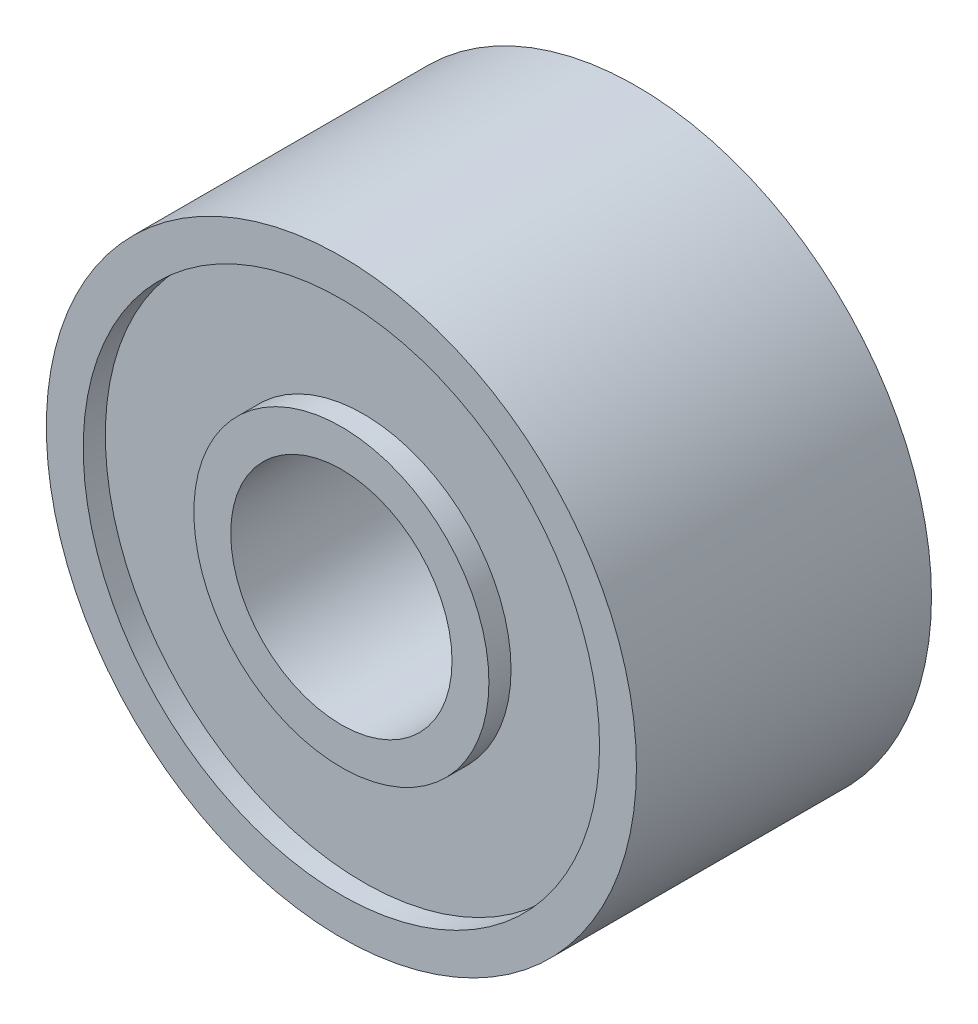
ISO-10303-21;
HEADER;
FILE_DESCRIPTION(('STEP AP214'),'2;1');
FILE_NAME('part.step','',(''),(''),'','','');
FILE_SCHEMA(('AUTOMOTIVE_DESIGN { 1 0 10303 214 1 1 1 1 }'));
ENDSEC;
DATA;
#1=APPLICATION_CONTEXT('core data for automotive mechanical design processes');
#2=APPLICATION_PROTOCOL_DEFINITION('international standard','automotive_design',2000,#1);
#3=PRODUCT_CONTEXT('',#1,'mechanical');
#4=PRODUCT('Part','Part','',(#3));
#5=PRODUCT_RELATED_PRODUCT_CATEGORY('part','',(#4));
#6=PRODUCT_DEFINITION_FORMATION('','',#4);
#7=PRODUCT_DEFINITION_CONTEXT('part definition',#1,'design');
#8=PRODUCT_DEFINITION('design','',#6,#7);
#9=PRODUCT_DEFINITION_SHAPE('','',#8);
#10=(LENGTH_UNIT() NAMED_UNIT(*) SI_UNIT(.MILLI.,.METRE.));
#11=(NAMED_UNIT(*) PLANE_ANGLE_UNIT() SI_UNIT($,.RADIAN.));
#12=(NAMED_UNIT(*) SI_UNIT($,.STERADIAN.) SOLID_ANGLE_UNIT());
#13=UNCERTAINTY_MEASURE_WITH_UNIT(LENGTH_MEASURE(1.E-05),#10,'distance_accuracy_value','');
#14=(GEOMETRIC_REPRESENTATION_CONTEXT(3) GLOBAL_UNCERTAINTY_ASSIGNED_CONTEXT((#13)) GLOBAL_UNIT_ASSIGNED_CONTEXT((#10,
#11,#12)) REPRESENTATION_CONTEXT('',''));
#15=CARTESIAN_POINT('',(0.,0.,0.));
#16=DIRECTION('',(0.,0.,1.));
#17=DIRECTION('',(1.,0.,0.));
#18=AXIS2_PLACEMENT_3D('',#15,#16,#17);
#19=CARTESIAN_POINT('',(0.,0.,0.));
#20=DIRECTION('',(0.,0.,1.));
#21=DIRECTION('',(1.,0.,0.));
#22=AXIS2_PLACEMENT_3D('',#19,#20,#21);
#23=PLANE('',#22);
#24=CARTESIAN_POINT('',(0.,0.,0.));
#25=DIRECTION('',(0.,0.,1.));
#26=DIRECTION('',(1.,0.,0.));
#27=AXIS2_PLACEMENT_3D('',#24,#25,#26);
#28=CIRCLE('',#27,1.5);
#29=CARTESIAN_POINT('',(1.5,0.,0.));
#30=VERTEX_POINT('',#29);
#31=EDGE_CURVE('E41',#30,#30,#28,.T.);
#32=ORIENTED_EDGE('',*,*,#31,.T.);
#33=EDGE_LOOP('',(#32));
#34=FACE_BOUND('',#33,.T.);
#35=CARTESIAN_POINT('',(0.,0.,0.));
#36=DIRECTION('',(0.,0.,-1.));
#37=DIRECTION('',(-1.,0.,0.));
#38=AXIS2_PLACEMENT_3D('',#35,#36,#37);
#39=CIRCLE('',#38,2.);
#40=CARTESIAN_POINT('',(-2.,0.,0.));
#41=VERTEX_POINT('',#40);
#42=EDGE_CURVE('E67',#41,#41,#39,.T.);
#43=ORIENTED_EDGE('',*,*,#42,.T.);
#44=EDGE_LOOP('',(#43));
#45=FACE_BOUND('',#44,.T.);
#46=ADVANCED_FACE('F30',(#34,#45),#23,.F.);
#47=CARTESIAN_POINT('',(0.,0.,4.));
#48=DIRECTION('',(0.,0.,1.));
#49=DIRECTION('',(1.,0.,0.));
#50=AXIS2_PLACEMENT_3D('',#47,#48,#49);
#51=PLANE('',#50);
#52=CARTESIAN_POINT('',(0.,0.,4.));
#53=DIRECTION('',(0.,0.,1.));
#54=DIRECTION('',(1.,0.,0.));
#55=AXIS2_PLACEMENT_3D('',#52,#53,#54);
#56=CIRCLE('',#55,1.5);
#57=CARTESIAN_POINT('',(1.5,0.,4.));
#58=VERTEX_POINT('',#57);
#59=EDGE_CURVE('E43',#58,#58,#56,.T.);
#60=ORIENTED_EDGE('',*,*,#59,.F.);
#61=EDGE_LOOP('',(#60));
#62=FACE_BOUND('',#61,.T.);
#63=CARTESIAN_POINT('',(0.,0.,4.));
#64=DIRECTION('',(0.,0.,1.));
#65=DIRECTION('',(1.,0.,0.));
#66=AXIS2_PLACEMENT_3D('',#63,#64,#65);
#67=CIRCLE('',#66,2.);
#68=CARTESIAN_POINT('',(2.,0.,4.));
#69=VERTEX_POINT('',#68);
#70=EDGE_CURVE('E55',#69,#69,#67,.T.);
#71=ORIENTED_EDGE('',*,*,#70,.T.);
#72=EDGE_LOOP('',(#71));
#73=FACE_BOUND('',#72,.T.);
#74=ADVANCED_FACE('F97',(#62,#73),#51,.T.);
#75=CARTESIAN_POINT('',(0.,0.,4.));
#76=DIRECTION('',(0.,0.,-1.));
#77=DIRECTION('',(-1.,0.,0.));
#78=AXIS2_PLACEMENT_3D('',#75,#76,#77);
#79=CYLINDRICAL_SURFACE('',#78,4.);
#80=CARTESIAN_POINT('',(0.,0.,4.));
#81=DIRECTION('',(0.,0.,1.));
#82=DIRECTION('',(1.,0.,0.));
#83=AXIS2_PLACEMENT_3D('',#80,#81,#82);
#84=CIRCLE('',#83,4.);
#85=CARTESIAN_POINT('',(4.,0.,4.));
#86=VERTEX_POINT('',#85);
#87=EDGE_CURVE('E10',#86,#86,#84,.T.);
#88=ORIENTED_EDGE('',*,*,#87,.F.);
#89=EDGE_LOOP('',(#88));
#90=FACE_BOUND('',#89,.T.);
#91=CARTESIAN_POINT('',(0.,0.,0.));
#92=DIRECTION('',(0.,0.,1.));
#93=DIRECTION('',(1.,0.,0.));
#94=AXIS2_PLACEMENT_3D('',#91,#92,#93);
#95=CIRCLE('',#94,4.);
#96=CARTESIAN_POINT('',(4.,0.,0.));
#97=VERTEX_POINT('',#96);
#98=EDGE_CURVE('E34',#97,#97,#95,.T.);
#99=ORIENTED_EDGE('',*,*,#98,.T.);
#100=EDGE_LOOP('',(#99));
#101=FACE_BOUND('',#100,.T.);
#102=ADVANCED_FACE('F32',(#90,#101),#79,.T.);
#103=CARTESIAN_POINT('',(0.,0.,4.));
#104=DIRECTION('',(0.,0.,1.));
#105=DIRECTION('',(1.,0.,0.));
#106=AXIS2_PLACEMENT_3D('',#103,#104,#105);
#107=CIRCLE('',#106,3.5);
#108=CARTESIAN_POINT('',(3.5,0.,4.));
#109=VERTEX_POINT('',#108);
#110=EDGE_CURVE('E49',#109,#109,#107,.T.);
#111=ORIENTED_EDGE('',*,*,#110,.F.);
#112=EDGE_LOOP('',(#111));
#113=FACE_BOUND('',#112,.T.);
#114=ORIENTED_EDGE('',*,*,#87,.T.);
#115=EDGE_LOOP('',(#114));
#116=FACE_BOUND('',#115,.T.);
#117=ADVANCED_FACE('F93',(#113,#116),#51,.T.);
#118=CARTESIAN_POINT('',(0.,0.,0.));
#119=DIRECTION('',(0.,0.,-1.));
#120=DIRECTION('',(-1.,0.,0.));
#121=AXIS2_PLACEMENT_3D('',#118,#119,#120);
#122=CIRCLE('',#121,3.5);
#123=CARTESIAN_POINT('',(-3.5,0.,0.));
#124=VERTEX_POINT('',#123);
#125=EDGE_CURVE('E61',#124,#124,#122,.T.);
#126=ORIENTED_EDGE('',*,*,#125,.F.);
#127=EDGE_LOOP('',(#126));
#128=FACE_BOUND('',#127,.T.);
#129=ORIENTED_EDGE('',*,*,#98,.F.);
#130=EDGE_LOOP('',(#129));
#131=FACE_BOUND('',#130,.T.);
#132=ADVANCED_FACE('F89',(#128,#131),#23,.F.);
#133=CARTESIAN_POINT('',(0.,0.,0.));
#134=DIRECTION('',(0.,0.,1.));
#135=DIRECTION('',(1.,0.,0.));
#136=AXIS2_PLACEMENT_3D('',#133,#134,#135);
#137=CYLINDRICAL_SURFACE('',#136,1.5);
#138=ORIENTED_EDGE('',*,*,#31,.F.);
#139=EDGE_LOOP('',(#138));
#140=FACE_BOUND('',#139,.T.);
#141=ORIENTED_EDGE('',*,*,#59,.T.);
#142=EDGE_LOOP('',(#141));
#143=FACE_BOUND('',#142,.T.);
#144=ADVANCED_FACE('F92',(#140,#143),#137,.F.);
#145=CARTESIAN_POINT('',(0.,0.,3.7));
#146=DIRECTION('',(0.,0.,1.));
#147=DIRECTION('',(1.,0.,0.));
#148=AXIS2_PLACEMENT_3D('',#145,#146,#147);
#149=CYLINDRICAL_SURFACE('',#148,3.5);
#150=CARTESIAN_POINT('',(0.,0.,3.7));
#151=DIRECTION('',(0.,0.,1.));
#152=DIRECTION('',(1.,0.,0.));
#153=AXIS2_PLACEMENT_3D('',#150,#151,#152);
#154=CIRCLE('',#153,3.5);
#155=CARTESIAN_POINT('',(3.5,0.,3.7));
#156=VERTEX_POINT('',#155);
#157=EDGE_CURVE('E46',#156,#156,#154,.T.);
#158=ORIENTED_EDGE('',*,*,#157,.F.);
#159=EDGE_LOOP('',(#158));
#160=FACE_BOUND('',#159,.T.);
#161=ORIENTED_EDGE('',*,*,#110,.T.);
#162=EDGE_LOOP('',(#161));
#163=FACE_BOUND('',#162,.T.);
#164=ADVANCED_FACE('F114',(#160,#163),#149,.F.);
#165=CARTESIAN_POINT('',(0.,0.,3.7));
#166=DIRECTION('',(0.,0.,1.));
#167=DIRECTION('',(1.,0.,0.));
#168=AXIS2_PLACEMENT_3D('',#165,#166,#167);
#169=PLANE('',#168);
#170=CARTESIAN_POINT('',(0.,0.,3.7));
#171=DIRECTION('',(0.,0.,1.));
#172=DIRECTION('',(1.,0.,0.));
#173=AXIS2_PLACEMENT_3D('',#170,#171,#172);
#174=CIRCLE('',#173,2.);
#175=CARTESIAN_POINT('',(2.,0.,3.7));
#176=VERTEX_POINT('',#175);
#177=EDGE_CURVE('E52',#176,#176,#174,.T.);
#178=ORIENTED_EDGE('',*,*,#177,.F.);
#179=EDGE_LOOP('',(#178));
#180=FACE_BOUND('',#179,.T.);
#181=ORIENTED_EDGE('',*,*,#157,.T.);
#182=EDGE_LOOP('',(#181));
#183=FACE_BOUND('',#182,.T.);
#184=ADVANCED_FACE('F118',(#180,#183),#169,.T.);
#185=CARTESIAN_POINT('',(0.,0.,3.7));
#186=DIRECTION('',(0.,0.,1.));
#187=DIRECTION('',(1.,0.,0.));
#188=AXIS2_PLACEMENT_3D('',#185,#186,#187);
#189=CYLINDRICAL_SURFACE('',#188,2.);
#190=ORIENTED_EDGE('',*,*,#177,.T.);
#191=EDGE_LOOP('',(#190));
#192=FACE_BOUND('',#191,.T.);
#193=ORIENTED_EDGE('',*,*,#70,.F.);
#194=EDGE_LOOP('',(#193));
#195=FACE_BOUND('',#194,.T.);
#196=ADVANCED_FACE('F85',(#192,#195),#189,.T.);
#197=CARTESIAN_POINT('',(0.,0.,0.3));
#198=DIRECTION('',(0.,0.,-1.));
#199=DIRECTION('',(-1.,0.,0.));
#200=AXIS2_PLACEMENT_3D('',#197,#198,#199);
#201=CYLINDRICAL_SURFACE('',#200,3.5);
#202=CARTESIAN_POINT('',(0.,0.,0.3));
#203=DIRECTION('',(0.,0.,-1.));
#204=DIRECTION('',(-1.,0.,0.));
#205=AXIS2_PLACEMENT_3D('',#202,#203,#204);
#206=CIRCLE('',#205,3.5);
#207=CARTESIAN_POINT('',(-3.5,0.,0.3));
#208=VERTEX_POINT('',#207);
#209=EDGE_CURVE('E58',#208,#208,#206,.T.);
#210=ORIENTED_EDGE('',*,*,#209,.F.);
#211=EDGE_LOOP('',(#210));
#212=FACE_BOUND('',#211,.T.);
#213=ORIENTED_EDGE('',*,*,#125,.T.);
#214=EDGE_LOOP('',(#213));
#215=FACE_BOUND('',#214,.T.);
#216=ADVANCED_FACE('F79',(#212,#215),#201,.F.);
#217=CARTESIAN_POINT('',(0.,0.,0.3));
#218=DIRECTION('',(0.,0.,-1.));
#219=DIRECTION('',(-1.,0.,0.));
#220=AXIS2_PLACEMENT_3D('',#217,#218,#219);
#221=PLANE('',#220);
#222=CARTESIAN_POINT('',(0.,0.,0.3));
#223=DIRECTION('',(0.,0.,-1.));
#224=DIRECTION('',(-1.,0.,0.));
#225=AXIS2_PLACEMENT_3D('',#222,#223,#224);
#226=CIRCLE('',#225,2.);
#227=CARTESIAN_POINT('',(-2.,0.,0.3));
#228=VERTEX_POINT('',#227);
#229=EDGE_CURVE('E64',#228,#228,#226,.T.);
#230=ORIENTED_EDGE('',*,*,#229,.F.);
#231=EDGE_LOOP('',(#230));
#232=FACE_BOUND('',#231,.T.);
#233=ORIENTED_EDGE('',*,*,#209,.T.);
#234=EDGE_LOOP('',(#233));
#235=FACE_BOUND('',#234,.T.);
#236=ADVANCED_FACE('F76',(#232,#235),#221,.T.);
#237=CARTESIAN_POINT('',(0.,0.,0.3));
#238=DIRECTION('',(0.,0.,-1.));
#239=DIRECTION('',(-1.,0.,0.));
#240=AXIS2_PLACEMENT_3D('',#237,#238,#239);
#241=CYLINDRICAL_SURFACE('',#240,2.);
#242=ORIENTED_EDGE('',*,*,#229,.T.);
#243=EDGE_LOOP('',(#242));
#244=FACE_BOUND('',#243,.T.);
#245=ORIENTED_EDGE('',*,*,#42,.F.);
#246=EDGE_LOOP('',(#245));
#247=FACE_BOUND('',#246,.T.);
#248=ADVANCED_FACE('F73',(#244,#247),#241,.T.);
#249=CLOSED_SHELL('',(#46,#74,#102,#117,#132,#144,#164,#184,#196,#216,#236,#248));
#250=MANIFOLD_SOLID_BREP('B2',#249);
#251=ADVANCED_BREP_SHAPE_REPRESENTATION('',(#18,#250),#14);
#252=SHAPE_DEFINITION_REPRESENTATION(#9,#251);
ENDSEC;
END-ISO-10303-21;
